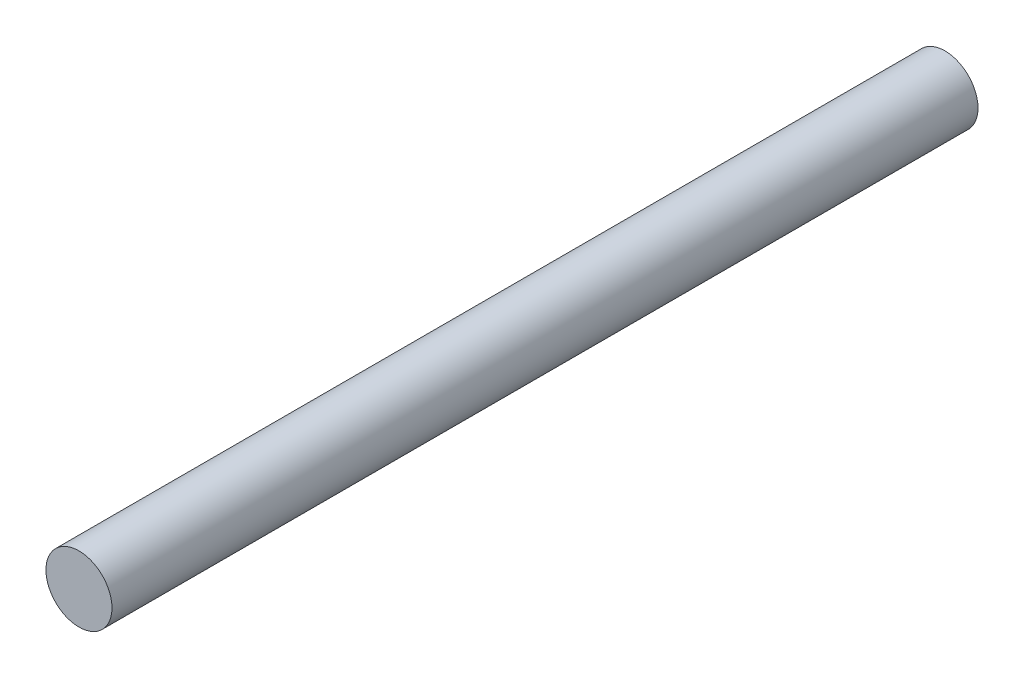
ISO-10303-21;
HEADER;
FILE_DESCRIPTION(('STEP AP214'),'2;1');
FILE_NAME('part.step','',(''),(''),'','','');
FILE_SCHEMA(('AUTOMOTIVE_DESIGN { 1 0 10303 214 1 1 1 1 }'));
ENDSEC;
DATA;
#1=APPLICATION_CONTEXT('core data for automotive mechanical design processes');
#2=APPLICATION_PROTOCOL_DEFINITION('international standard','automotive_design',2000,#1);
#3=PRODUCT_CONTEXT('',#1,'mechanical');
#4=PRODUCT('Part','Part','',(#3));
#5=PRODUCT_RELATED_PRODUCT_CATEGORY('part','',(#4));
#6=PRODUCT_DEFINITION_FORMATION('','',#4);
#7=PRODUCT_DEFINITION_CONTEXT('part definition',#1,'design');
#8=PRODUCT_DEFINITION('design','',#6,#7);
#9=PRODUCT_DEFINITION_SHAPE('','',#8);
#10=(LENGTH_UNIT() NAMED_UNIT(*) SI_UNIT(.MILLI.,.METRE.));
#11=(NAMED_UNIT(*) PLANE_ANGLE_UNIT() SI_UNIT($,.RADIAN.));
#12=(NAMED_UNIT(*) SI_UNIT($,.STERADIAN.) SOLID_ANGLE_UNIT());
#13=UNCERTAINTY_MEASURE_WITH_UNIT(LENGTH_MEASURE(1.E-05),#10,'distance_accuracy_value','');
#14=(GEOMETRIC_REPRESENTATION_CONTEXT(3) GLOBAL_UNCERTAINTY_ASSIGNED_CONTEXT((#13)) GLOBAL_UNIT_ASSIGNED_CONTEXT((#10,
#11,#12)) REPRESENTATION_CONTEXT('',''));
#15=CARTESIAN_POINT('',(0.,0.,0.));
#16=DIRECTION('',(0.,0.,1.));
#17=DIRECTION('',(1.,0.,0.));
#18=AXIS2_PLACEMENT_3D('',#15,#16,#17);
#19=CARTESIAN_POINT('',(0.,0.,499.6434));
#20=DIRECTION('',(0.,0.,1.));
#21=DIRECTION('',(1.,0.,0.));
#22=AXIS2_PLACEMENT_3D('',#19,#20,#21);
#23=PLANE('',#22);
#24=CARTESIAN_POINT('',(0.,0.,499.6434));
#25=DIRECTION('',(0.,0.,1.));
#26=DIRECTION('',(1.,0.,0.));
#27=AXIS2_PLACEMENT_3D('',#24,#25,#26);
#28=CIRCLE('',#27,19.05);
#29=CARTESIAN_POINT('',(19.05,0.,499.6434));
#30=VERTEX_POINT('',#29);
#31=EDGE_CURVE('E18',#30,#30,#28,.F.);
#32=ORIENTED_EDGE('',*,*,#31,.F.);
#33=EDGE_LOOP('',(#32));
#34=FACE_BOUND('',#33,.T.);
#35=ADVANCED_FACE('F15',(#34),#23,.T.);
#36=CARTESIAN_POINT('',(0.,0.,0.));
#37=DIRECTION('',(0.,0.,1.));
#38=DIRECTION('',(1.,0.,0.));
#39=AXIS2_PLACEMENT_3D('',#36,#37,#38);
#40=PLANE('',#39);
#41=CARTESIAN_POINT('',(0.,0.,0.));
#42=DIRECTION('',(0.,0.,1.));
#43=DIRECTION('',(1.,0.,0.));
#44=AXIS2_PLACEMENT_3D('',#41,#42,#43);
#45=CIRCLE('',#44,19.05);
#46=CARTESIAN_POINT('',(19.05,0.,0.));
#47=VERTEX_POINT('',#46);
#48=EDGE_CURVE('E10',#47,#47,#45,.T.);
#49=ORIENTED_EDGE('',*,*,#48,.F.);
#50=EDGE_LOOP('',(#49));
#51=FACE_BOUND('',#50,.T.);
#52=ADVANCED_FACE('F30',(#51),#40,.F.);
#53=CARTESIAN_POINT('',(0.,0.,0.));
#54=DIRECTION('',(0.,0.,1.));
#55=DIRECTION('',(1.,0.,0.));
#56=AXIS2_PLACEMENT_3D('',#53,#54,#55);
#57=CYLINDRICAL_SURFACE('',#56,19.05);
#58=ORIENTED_EDGE('',*,*,#48,.T.);
#59=EDGE_LOOP('',(#58));
#60=FACE_BOUND('',#59,.T.);
#61=ORIENTED_EDGE('',*,*,#31,.T.);
#62=EDGE_LOOP('',(#61));
#63=FACE_BOUND('',#62,.T.);
#64=ADVANCED_FACE('F27',(#60,#63),#57,.T.);
#65=CLOSED_SHELL('',(#35,#52,#64));
#66=MANIFOLD_SOLID_BREP('B1',#65);
#67=ADVANCED_BREP_SHAPE_REPRESENTATION('',(#18,#66),#14);
#68=SHAPE_DEFINITION_REPRESENTATION(#9,#67);
ENDSEC;
END-ISO-10303-21;
